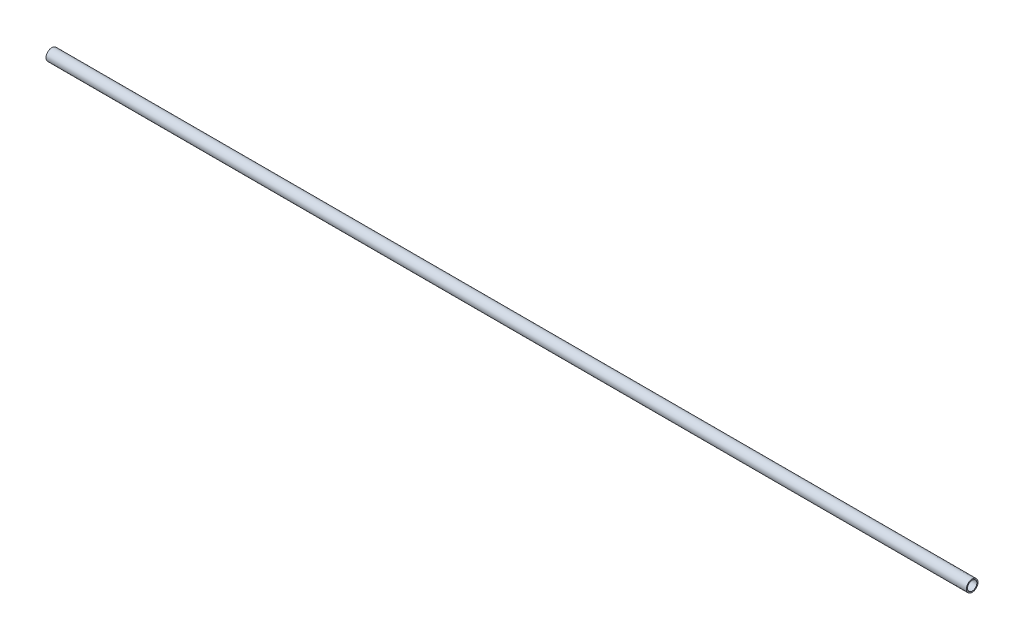
ISO-10303-21;
HEADER;
FILE_DESCRIPTION(('STEP AP214'),'2;1');
FILE_NAME('part.step','',(''),(''),'','','');
FILE_SCHEMA(('AUTOMOTIVE_DESIGN { 1 0 10303 214 1 1 1 1 }'));
ENDSEC;
DATA;
#1=APPLICATION_CONTEXT('core data for automotive mechanical design processes');
#2=APPLICATION_PROTOCOL_DEFINITION('international standard','automotive_design',2000,#1);
#3=PRODUCT_CONTEXT('',#1,'mechanical');
#4=PRODUCT('Part','Part','',(#3));
#5=PRODUCT_RELATED_PRODUCT_CATEGORY('part','',(#4));
#6=PRODUCT_DEFINITION_FORMATION('','',#4);
#7=PRODUCT_DEFINITION_CONTEXT('part definition',#1,'design');
#8=PRODUCT_DEFINITION('design','',#6,#7);
#9=PRODUCT_DEFINITION_SHAPE('','',#8);
#10=(LENGTH_UNIT() NAMED_UNIT(*) SI_UNIT(.MILLI.,.METRE.));
#11=(NAMED_UNIT(*) PLANE_ANGLE_UNIT() SI_UNIT($,.RADIAN.));
#12=(NAMED_UNIT(*) SI_UNIT($,.STERADIAN.) SOLID_ANGLE_UNIT());
#13=UNCERTAINTY_MEASURE_WITH_UNIT(LENGTH_MEASURE(1.E-05),#10,'distance_accuracy_value','');
#14=(GEOMETRIC_REPRESENTATION_CONTEXT(3) GLOBAL_UNCERTAINTY_ASSIGNED_CONTEXT((#13)) GLOBAL_UNIT_ASSIGNED_CONTEXT((#10,
#11,#12)) REPRESENTATION_CONTEXT('',''));
#15=CARTESIAN_POINT('',(0.,0.,0.));
#16=DIRECTION('',(0.,0.,1.));
#17=DIRECTION('',(1.,0.,0.));
#18=AXIS2_PLACEMENT_3D('',#15,#16,#17);
#19=CARTESIAN_POINT('',(40.,0.,0.));
#20=DIRECTION('',(1.,0.,0.));
#21=DIRECTION('',(0.,0.,-1.));
#22=AXIS2_PLACEMENT_3D('',#19,#20,#21);
#23=PLANE('',#22);
#24=CARTESIAN_POINT('',(40.,0.,0.));
#25=DIRECTION('',(1.,0.,0.));
#26=DIRECTION('',(0.,0.,-1.));
#27=AXIS2_PLACEMENT_3D('',#24,#25,#26);
#28=CIRCLE('',#27,0.254);
#29=CARTESIAN_POINT('',(40.,0.,-0.254));
#30=VERTEX_POINT('',#29);
#31=EDGE_CURVE('E10',#30,#30,#28,.T.);
#32=ORIENTED_EDGE('',*,*,#31,.T.);
#33=EDGE_LOOP('',(#32));
#34=FACE_BOUND('',#33,.T.);
#35=CARTESIAN_POINT('',(40.,0.,0.));
#36=DIRECTION('',(1.,0.,0.));
#37=DIRECTION('',(0.,0.,-1.));
#38=AXIS2_PLACEMENT_3D('',#35,#36,#37);
#39=CIRCLE('',#38,0.2032);
#40=CARTESIAN_POINT('',(40.,0.,-0.2032));
#41=VERTEX_POINT('',#40);
#42=EDGE_CURVE('E51',#41,#41,#39,.T.);
#43=ORIENTED_EDGE('',*,*,#42,.F.);
#44=EDGE_LOOP('',(#43));
#45=FACE_BOUND('',#44,.T.);
#46=ADVANCED_FACE('F33',(#34,#45),#23,.T.);
#47=CARTESIAN_POINT('',(0.,0.,0.));
#48=DIRECTION('',(1.,0.,0.));
#49=DIRECTION('',(0.,0.,-1.));
#50=AXIS2_PLACEMENT_3D('',#47,#48,#49);
#51=PLANE('',#50);
#52=CARTESIAN_POINT('',(0.,0.,0.));
#53=DIRECTION('',(1.,0.,0.));
#54=DIRECTION('',(0.,0.,-1.));
#55=AXIS2_PLACEMENT_3D('',#52,#53,#54);
#56=CIRCLE('',#55,0.254);
#57=CARTESIAN_POINT('',(0.,0.,-0.254));
#58=VERTEX_POINT('',#57);
#59=EDGE_CURVE('E46',#58,#58,#56,.T.);
#60=ORIENTED_EDGE('',*,*,#59,.F.);
#61=EDGE_LOOP('',(#60));
#62=FACE_BOUND('',#61,.T.);
#63=CARTESIAN_POINT('',(0.,0.,0.));
#64=DIRECTION('',(1.,0.,0.));
#65=DIRECTION('',(0.,0.,-1.));
#66=AXIS2_PLACEMENT_3D('',#63,#64,#65);
#67=CIRCLE('',#66,0.2032);
#68=CARTESIAN_POINT('',(0.,0.,-0.2032));
#69=VERTEX_POINT('',#68);
#70=EDGE_CURVE('E53',#69,#69,#67,.T.);
#71=ORIENTED_EDGE('',*,*,#70,.T.);
#72=EDGE_LOOP('',(#71));
#73=FACE_BOUND('',#72,.T.);
#74=ADVANCED_FACE('F73',(#62,#73),#51,.F.);
#75=CARTESIAN_POINT('',(40.,0.,0.));
#76=DIRECTION('',(-1.,0.,0.));
#77=DIRECTION('',(0.,0.,1.));
#78=AXIS2_PLACEMENT_3D('',#75,#76,#77);
#79=CYLINDRICAL_SURFACE('',#78,0.254);
#80=CARTESIAN_POINT('',(39.4196593617693,-0.156575860208404,0.199999999999996));
#81=CARTESIAN_POINT('',(39.4273232414501,-0.156578127590141,0.199998959837885));
#82=CARTESIAN_POINT('',(39.4349983210639,-0.157150101667018,0.199554493411874));
#83=CARTESIAN_POINT('',(39.4501099070562,-0.159331610656761,0.197816019316266));
#84=CARTESIAN_POINT('',(39.4575455392837,-0.160944575003501,0.196519203409457));
#85=CARTESIAN_POINT('',(39.4744411131732,-0.165622152728621,0.192606546141106));
#86=CARTESIAN_POINT('',(39.483745618685,-0.168991942500219,0.189694501187114));
#87=CARTESIAN_POINT('',(39.5015681079646,-0.176520052730397,0.182710468439602));
#88=CARTESIAN_POINT('',(39.510083872383,-0.180680503337848,0.178635331880377));
#89=CARTESIAN_POINT('',(39.529063125135,-0.190789428167503,0.167888122835688));
#90=CARTESIAN_POINT('',(39.5392232207103,-0.196869930901784,0.160803416076543));
#91=CARTESIAN_POINT('',(39.5581169555454,-0.208887470896208,0.144851504507567));
#92=CARTESIAN_POINT('',(39.5668517401028,-0.214824620045493,0.135985743759721));
#93=CARTESIAN_POINT('',(39.5811771888413,-0.224907920324756,0.118383825779077));
#94=CARTESIAN_POINT('',(39.5870495373387,-0.229179104691044,0.109949419826993));
#95=CARTESIAN_POINT('',(39.5975388740471,-0.236948729083354,0.0920130609990207));
#96=CARTESIAN_POINT('',(39.6021577759885,-0.240448345569685,0.08251276720155));
#97=CARTESIAN_POINT('',(39.609295915055,-0.245913929660451,0.0641787310714038));
#98=CARTESIAN_POINT('',(39.61203131012,-0.248034660266344,0.0554758120648191));
#99=CARTESIAN_POINT('',(39.616305170358,-0.25136379311449,0.0376111632010834));
#100=CARTESIAN_POINT('',(39.6178442779185,-0.252572684989426,0.0284496824016389));
#101=CARTESIAN_POINT('',(39.6196325215224,-0.253978253586905,0.00989281703171284));
#102=CARTESIAN_POINT('',(39.6198775138112,-0.25417167877498,0.000496777771226711));
#103=CARTESIAN_POINT('',(39.6190492468918,-0.253519746569042,-0.0182003547114571));
#104=CARTESIAN_POINT('',(39.6179758869564,-0.252674309801971,-0.0275014406241039));
#105=CARTESIAN_POINT('',(39.6146681290115,-0.250086847019841,-0.0452681776783455));
#106=CARTESIAN_POINT('',(39.6124945421666,-0.248391822740428,-0.0537523421483156));
#107=CARTESIAN_POINT('',(39.6071347467399,-0.244254222745689,-0.0701987526710312));
#108=CARTESIAN_POINT('',(39.6039482901956,-0.241811463981504,-0.0781608703441505));
#109=CARTESIAN_POINT('',(39.5963280031841,-0.236052853783652,-0.0942060382400424));
#110=CARTESIAN_POINT('',(39.5918015473612,-0.232674276725328,-0.102222154866371));
#111=CARTESIAN_POINT('',(39.5818314269053,-0.225397789925583,-0.117400207173861));
#112=CARTESIAN_POINT('',(39.5763871849547,-0.221499553626524,-0.124561600332938));
#113=CARTESIAN_POINT('',(39.5635031141067,-0.212558587838691,-0.139370353316671));
#114=CARTESIAN_POINT('',(39.555882863361,-0.207444827160126,-0.146817643070398));
#115=CARTESIAN_POINT('',(39.5395914169174,-0.197128614009353,-0.160402686953822));
#116=CARTESIAN_POINT('',(39.5309191242637,-0.191926073908227,-0.166539055472437));
#117=CARTESIAN_POINT('',(39.5137285214561,-0.182537558073003,-0.176742012103085));
#118=CARTESIAN_POINT('',(39.5053325389688,-0.178306692978332,-0.180972981908948));
#119=CARTESIAN_POINT('',(39.4877495375082,-0.170558850653808,-0.188292278784968));
#120=CARTESIAN_POINT('',(39.4785643171527,-0.167040308489364,-0.191383123214038));
#121=CARTESIAN_POINT('',(39.4620693092009,-0.162083282165824,-0.195582785156542));
#122=CARTESIAN_POINT('',(39.4549330570381,-0.160339127212091,-0.197002428434777));
#123=CARTESIAN_POINT('',(39.4403904286241,-0.157781183572826,-0.199057500688183));
#124=CARTESIAN_POINT('',(39.4329846242336,-0.156965531650072,-0.199694500407348));
#125=CARTESIAN_POINT('',(39.4180731634206,-0.156406141570308,-0.20013320610242));
#126=CARTESIAN_POINT('',(39.4105672140719,-0.156667042561435,-0.199931296974719));
#127=CARTESIAN_POINT('',(39.3957287595549,-0.15822103460147,-0.198703245619559));
#128=CARTESIAN_POINT('',(39.3883965260532,-0.159515644958736,-0.197675890167253));
#129=CARTESIAN_POINT('',(39.3720264603483,-0.163415368924034,-0.194471898072725));
#130=CARTESIAN_POINT('',(39.3631030346635,-0.166289953180502,-0.192050047883656));
#131=CARTESIAN_POINT('',(39.3459400190218,-0.172879251097439,-0.1861407143496));
#132=CARTESIAN_POINT('',(39.3377026376033,-0.176596544752892,-0.182649946703576));
#133=CARTESIAN_POINT('',(39.3187095510656,-0.18604764903528,-0.17310024676556));
#134=CARTESIAN_POINT('',(39.3082912866882,-0.191986925646759,-0.166574176288042));
#135=CARTESIAN_POINT('',(39.2888252972694,-0.203899265349916,-0.151762318087066));
#136=CARTESIAN_POINT('',(39.27977735208,-0.209872322854251,-0.143476813539686));
#137=CARTESIAN_POINT('',(39.2644433878661,-0.220413511625667,-0.126561494654802));
#138=CARTESIAN_POINT('',(39.2579466384245,-0.225057805705784,-0.118171076214495));
#139=CARTESIAN_POINT('',(39.2462417529336,-0.233610200087683,-0.100203971967722));
#140=CARTESIAN_POINT('',(39.2410314344573,-0.23751954450328,-0.0906293371936354));
#141=CARTESIAN_POINT('',(39.2329330725399,-0.243674199250097,-0.0722205221789213));
#142=CARTESIAN_POINT('',(39.2297975810038,-0.246091355928125,-0.0635532681055296));
#143=CARTESIAN_POINT('',(39.2247243030009,-0.250026178272363,-0.0456776455077952));
#144=CARTESIAN_POINT('',(39.222785831764,-0.251544358188755,-0.036469589663727));
#145=CARTESIAN_POINT('',(39.2202204312395,-0.253557182399072,-0.0177192905902397));
#146=CARTESIAN_POINT('',(39.21959906162,-0.254047487797213,-0.00817580291768501));
#147=CARTESIAN_POINT('',(39.2197289097175,-0.253945230503872,0.0108957583807674));
#148=CARTESIAN_POINT('',(39.2204800324169,-0.253352742774152,0.0204238330280025));
#149=CARTESIAN_POINT('',(39.2232040980725,-0.251217097791009,0.0385139858572853));
#150=CARTESIAN_POINT('',(39.2250901843585,-0.24974155916754,0.0470976188431021));
#151=CARTESIAN_POINT('',(39.2299047273509,-0.246009176930633,0.0637861387269432));
#152=CARTESIAN_POINT('',(39.2328334367438,-0.243752143920567,0.0718909090137917));
#153=CARTESIAN_POINT('',(39.2398785550218,-0.238393541717935,0.0881090064797993));
#154=CARTESIAN_POINT('',(39.2440711271354,-0.235238927916474,0.0961713426202595));
#155=CARTESIAN_POINT('',(39.2533737855544,-0.228379128837239,0.111487747143032));
#156=CARTESIAN_POINT('',(39.2584843043656,-0.2246736841688,0.118741431893465));
#157=CARTESIAN_POINT('',(39.2705832251006,-0.216142792924745,0.133740619608277));
#158=CARTESIAN_POINT('',(39.2777433436427,-0.211240234408174,0.141303437194555));
#159=CARTESIAN_POINT('',(39.293081268497,-0.201255932304763,0.155194307450927));
#160=CARTESIAN_POINT('',(39.3012604211987,-0.196173958153954,0.161520697556002));
#161=CARTESIAN_POINT('',(39.3182461871069,-0.186424142711708,0.172669052870223));
#162=CARTESIAN_POINT('',(39.327015481516,-0.181747874747502,0.177540392316429));
#163=CARTESIAN_POINT('',(39.345466288401,-0.173074007637781,0.186005247511024));
#164=CARTESIAN_POINT('',(39.355146101226,-0.169075181541164,0.189601086596413));
#165=CARTESIAN_POINT('',(39.3723501080437,-0.163430393000711,0.194463545011836));
#166=CARTESIAN_POINT('',(39.3796524177544,-0.161438434579087,0.196105179804854));
#167=CARTESIAN_POINT('',(39.3945754610713,-0.158406547648849,0.198563270632884));
#168=CARTESIAN_POINT('',(39.402194874224,-0.157363017672933,0.199382849500251));
#169=CARTESIAN_POINT('',(39.4131210855868,-0.15667765212623,0.199920152744218));
#170=CARTESIAN_POINT('',(39.4163892040883,-0.156574892722469,0.200000443834484));
#171=CARTESIAN_POINT('',(39.4196593617693,-0.156575860208404,0.199999999999996));
#172=B_SPLINE_CURVE_WITH_KNOTS('',3,(#80,#81,#82,#83,#84,#85,#86,#87,#88,#89,#90,#91,#92,#93,
#94,#95,#96,#97,#98,#99,#100,#101,#102,#103,#104,#105,#106,#107,#108,#109,#110,#111,#112,#113,
#114,#115,#116,#117,#118,#119,#120,#121,#122,#123,#124,#125,#126,#127,#128,#129,#130,#131,#132,
#133,#134,#135,#136,#137,#138,#139,#140,#141,#142,#143,#144,#145,#146,#147,#148,#149,#150,#151,
#152,#153,#154,#155,#156,#157,#158,#159,#160,#161,#162,#163,#164,#165,#166,#167,#168,#169,#170,
#171),.UNSPECIFIED.,.T.,.F.,(4,2,2,2,2,2,2,2,2,2,2,2,2,2,2,2,2,2,2,2,2,2,2,2,2,2,2,2,2,2,2,2,2,
2,2,2,2,2,2,2,2,2,2,2,2,4),(0.,0.0229801860502137,0.0460364670619781,0.0768097055048268,
0.107667057775144,0.148863253724962,0.190026182020082,0.223288244919045,0.25649923471716,
0.284477516345091,0.31244076367777,0.340493495236776,0.368548370265846,0.395198823674424,
0.421855806461919,0.451167697318883,0.480498095584494,0.515826068059614,0.551191198568207,
0.582030438299981,0.612801172552488,0.635162064059315,0.657478004178451,0.679890209728139,
0.702335416689861,0.731222080644151,0.760198406323362,0.800953441176442,0.841701921583522,
0.876319069120658,0.910877078869043,0.939344183970967,0.96779498899446,0.996365651589588,
1.02493433631286,1.05155388434719,1.07817988819951,1.10693193929675,1.13569757310911,
1.1701064571117,1.20456129548758,1.23766132705012,1.270700753157,1.29385203636044,
1.31691503536175,1.32672062144255),.UNSPECIFIED.);
#173=CARTESIAN_POINT('',(39.4196593617693,-0.156575860208404,0.199999999999996));
#174=VERTEX_POINT('',#173);
#175=EDGE_CURVE('E56',#174,#174,#172,.T.);
#176=ORIENTED_EDGE('',*,*,#175,.T.);
#177=EDGE_LOOP('',(#176));
#178=FACE_BOUND('',#177,.T.);
#179=ORIENTED_EDGE('',*,*,#31,.F.);
#180=EDGE_LOOP('',(#179));
#181=FACE_BOUND('',#180,.T.);
#182=ORIENTED_EDGE('',*,*,#59,.T.);
#183=EDGE_LOOP('',(#182));
#184=FACE_BOUND('',#183,.T.);
#185=ADVANCED_FACE('F35',(#178,#181,#184),#79,.T.);
#186=CARTESIAN_POINT('',(40.,0.,0.));
#187=DIRECTION('',(-1.,0.,0.));
#188=DIRECTION('',(0.,0.,1.));
#189=AXIS2_PLACEMENT_3D('',#186,#187,#188);
#190=CYLINDRICAL_SURFACE('',#189,0.2032);
#191=CARTESIAN_POINT('',(39.4196593617693,-0.0359199109130549,0.199999999999996));
#192=CARTESIAN_POINT('',(39.4223450395615,-0.0359209682305299,0.199999876802438));
#193=CARTESIAN_POINT('',(39.4250325716959,-0.0362302920392039,0.199944898363608));
#194=CARTESIAN_POINT('',(39.4302971537246,-0.0373720910723908,0.199734534340309));
#195=CARTESIAN_POINT('',(39.4328733494263,-0.0382080338333731,0.199578483045861));
#196=CARTESIAN_POINT('',(39.4407323563739,-0.0413476194680317,0.198959939669976));
#197=CARTESIAN_POINT('',(39.445752793223,-0.0442380641766276,0.198350907673561));
#198=CARTESIAN_POINT('',(39.4554039995754,-0.0505507585804063,0.196840248496954));
#199=CARTESIAN_POINT('',(39.4600311092492,-0.0539773044629976,0.195936187217804));
#200=CARTESIAN_POINT('',(39.4786844144566,-0.068488358575185,0.191646462931429));
#201=CARTESIAN_POINT('',(39.4918138085672,-0.0803894722204894,0.187066561267769));
#202=CARTESIAN_POINT('',(39.517078310249,-0.103773576055693,0.175210811880812));
#203=CARTESIAN_POINT('',(39.5292163335447,-0.115257732809936,0.167943245150935));
#204=CARTESIAN_POINT('',(39.5490228159344,-0.134230437749928,0.152887813717858));
#205=CARTESIAN_POINT('',(39.5569992310813,-0.141945887874345,0.145799229298648));
#206=CARTESIAN_POINT('',(39.5720451231787,-0.156553525052951,0.129988841878766));
#207=CARTESIAN_POINT('',(39.5791157924799,-0.163446793609733,0.121269224031169));
#208=CARTESIAN_POINT('',(39.5904475761775,-0.174521306396466,0.104442969441182));
#209=CARTESIAN_POINT('',(39.5949766105207,-0.178957301326143,0.0966858970503532));
#210=CARTESIAN_POINT('',(39.6030809844731,-0.186904062823742,0.0802503143430608));
#211=CARTESIAN_POINT('',(39.6066575240292,-0.190415993454255,0.0715729828280691));
#212=CARTESIAN_POINT('',(39.6121583060332,-0.195820990744767,0.0548554014703442));
#213=CARTESIAN_POINT('',(39.6142529423054,-0.197880816037918,0.0469256890402841));
#214=CARTESIAN_POINT('',(39.6174644038293,-0.201039776337299,0.0306843692817245));
#215=CARTESIAN_POINT('',(39.6185818007285,-0.202139472981335,0.0223729882138329));
#216=CARTESIAN_POINT('',(39.6197592042729,-0.20329824245699,0.00557731340179369));
#217=CARTESIAN_POINT('',(39.6198161003772,-0.203354254069511,-0.00290741595034345));
#218=CARTESIAN_POINT('',(39.6188600252585,-0.202413283578777,-0.0197567716822355));
#219=CARTESIAN_POINT('',(39.6178469149318,-0.201416164565645,-0.0281213823029184));
#220=CARTESIAN_POINT('',(39.6148926330312,-0.198509959663775,-0.0441294079361143));
#221=CARTESIAN_POINT('',(39.6129935412682,-0.196642226798648,-0.051788368008223));
#222=CARTESIAN_POINT('',(39.6083983979198,-0.192126216001779,-0.0666179577160249));
#223=CARTESIAN_POINT('',(39.6057020168103,-0.189477615334286,-0.0737883839272157));
#224=CARTESIAN_POINT('',(39.598439576718,-0.18235115515984,-0.0902635236567009));
#225=CARTESIAN_POINT('',(39.5935555529188,-0.177563839900898,-0.099294488361263));
#226=CARTESIAN_POINT('',(39.5827973505764,-0.167041728862688,-0.116130587922009));
#227=CARTESIAN_POINT('',(39.5769212510028,-0.161305095283538,-0.123933286641159));
#228=CARTESIAN_POINT('',(39.5621042183562,-0.146891090233397,-0.140997721672682));
#229=CARTESIAN_POINT('',(39.552836848791,-0.137914154079874,-0.149720712681309));
#230=CARTESIAN_POINT('',(39.5333436772241,-0.119188363802053,-0.165016088101743));
#231=CARTESIAN_POINT('',(39.5231159159839,-0.109437938299845,-0.171583947738208));
#232=CARTESIAN_POINT('',(39.5035449561735,-0.0912036953830133,-0.181837395383443));
#233=CARTESIAN_POINT('',(39.4943113593193,-0.0827585661770147,-0.185812306093995));
#234=CARTESIAN_POINT('',(39.4752614108141,-0.0659933141946444,-0.192385875913187));
#235=CARTESIAN_POINT('',(39.4654472667882,-0.057672851831072,-0.194989417334263));
#236=CARTESIAN_POINT('',(39.4519950296613,-0.0482951429907103,-0.197388966091068));
#237=CARTESIAN_POINT('',(39.4490905948284,-0.0463770492849708,-0.197845553798704));
#238=CARTESIAN_POINT('',(39.4430961770811,-0.0428193135753583,-0.198645264912919));
#239=CARTESIAN_POINT('',(39.4400064104488,-0.0411793552278641,-0.198988517650278));
#240=CARTESIAN_POINT('',(39.434665569918,-0.0388818243442155,-0.199447619796648));
#241=CARTESIAN_POINT('',(39.4324821360144,-0.0380793750458713,-0.199601123149156));
#242=CARTESIAN_POINT('',(39.4280171832702,-0.0368177372140882,-0.19983771139575));
#243=CARTESIAN_POINT('',(39.4257360408778,-0.0363573380488388,-0.199921044786298));
#244=CARTESIAN_POINT('',(39.4210957146048,-0.0358742756909067,-0.20000839203536));
#245=CARTESIAN_POINT('',(39.4187359308086,-0.0358567806473564,-0.200011469416933));
#246=CARTESIAN_POINT('',(39.4140584610763,-0.0362786945220467,-0.199935318525233));
#247=CARTESIAN_POINT('',(39.4117408545499,-0.0367188895514074,-0.199855948643887));
#248=CARTESIAN_POINT('',(39.4063575565404,-0.0381845429522139,-0.199581729739767));
#249=CARTESIAN_POINT('',(39.403338928662,-0.0393680030812923,-0.199354642978288));
#250=CARTESIAN_POINT('',(39.3974940883011,-0.0421311467313348,-0.198789614875699));
#251=CARTESIAN_POINT('',(39.3946690548499,-0.0437130235650378,-0.198451056596627));
#252=CARTESIAN_POINT('',(39.3816965678239,-0.0515985650672188,-0.196638617503945));
#253=CARTESIAN_POINT('',(39.3724034677051,-0.0591045340836741,-0.194570111823358));
#254=CARTESIAN_POINT('',(39.3544095150025,-0.074381703371813,-0.189281981216477));
#255=CARTESIAN_POINT('',(39.345711817191,-0.0821540313512027,-0.18605671646439));
#256=CARTESIAN_POINT('',(39.3249230201453,-0.101177787357188,-0.176661553579133));
#257=CARTESIAN_POINT('',(39.3130894648981,-0.11240242375354,-0.1698195559006));
#258=CARTESIAN_POINT('',(39.290592208871,-0.133942376295508,-0.153406669149494));
#259=CARTESIAN_POINT('',(39.2799243264368,-0.144260914860033,-0.143846009670579));
#260=CARTESIAN_POINT('',(39.2640568733363,-0.159687629519487,-0.125982036093379));
#261=CARTESIAN_POINT('',(39.2583193732362,-0.165286158395173,-0.118580548932561));
#262=CARTESIAN_POINT('',(39.2477337250542,-0.175634560586067,-0.102629812546351));
#263=CARTESIAN_POINT('',(39.2428845179199,-0.180385444313656,-0.0940819514158115));
#264=CARTESIAN_POINT('',(39.2350869336657,-0.188033875032324,-0.0774730936868788));
#265=CARTESIAN_POINT('',(39.2319550652985,-0.191109652789989,-0.0695813147010702));
#266=CARTESIAN_POINT('',(39.2266662700892,-0.196306739931506,-0.0531765724914181));
#267=CARTESIAN_POINT('',(39.2245087252618,-0.19842865431942,-0.0446640070058993));
#268=CARTESIAN_POINT('',(39.2213131167558,-0.201572290355519,-0.0271705689621363));
#269=CARTESIAN_POINT('',(39.2202822753179,-0.202586914137894,-0.0181870575721794));
#270=CARTESIAN_POINT('',(39.2194551029789,-0.20340103083682,-0.000109079085930496));
#271=CARTESIAN_POINT('',(39.2196583106682,-0.203200977919737,0.00898534527094863));
#272=CARTESIAN_POINT('',(39.2211926754478,-0.201690979326478,0.0260050017739182));
#273=CARTESIAN_POINT('',(39.222402833643,-0.200500096638115,0.0339525274964295));
#274=CARTESIAN_POINT('',(39.2257121645579,-0.197245192109822,0.0494719610811296));
#275=CARTESIAN_POINT('',(39.2278114976344,-0.195181012776615,0.0570438009155212));
#276=CARTESIAN_POINT('',(39.2329111573368,-0.190170700113782,0.0720499018708407));
#277=CARTESIAN_POINT('',(39.2359527740443,-0.187184174295769,0.079456378497267));
#278=CARTESIAN_POINT('',(39.2427409699939,-0.180526766259493,0.0936032190361034));
#279=CARTESIAN_POINT('',(39.2464878595796,-0.176855582775729,0.100343287707837));
#280=CARTESIAN_POINT('',(39.2567855325796,-0.166782629112715,0.11666127576048));
#281=CARTESIAN_POINT('',(39.2637408009844,-0.159993759345331,0.125746541027557));
#282=CARTESIAN_POINT('',(39.2786365954087,-0.145514195327047,0.142256914719384));
#283=CARTESIAN_POINT('',(39.2865802212372,-0.137820668143438,0.149676584345826));
#284=CARTESIAN_POINT('',(39.3061967527781,-0.118973857497921,0.165334213854826));
#285=CARTESIAN_POINT('',(39.3181774896442,-0.107577588946257,0.172893384541268));
#286=CARTESIAN_POINT('',(39.3430752193131,-0.0844340895006477,0.185286017429951));
#287=CARTESIAN_POINT('',(39.3559904565147,-0.0726875398863773,0.190124448228639));
#288=CARTESIAN_POINT('',(39.3768811118311,-0.05568871717359,0.195511408676135));
#289=CARTESIAN_POINT('',(39.3842390475637,-0.0500338938573947,0.197003688670013));
#290=CARTESIAN_POINT('',(39.3947205247319,-0.0436872850475221,0.198454988128959));
#291=CARTESIAN_POINT('',(39.3973142049603,-0.0422387064285263,0.198765996642409));
#292=CARTESIAN_POINT('',(39.40266890669,-0.0396652082737693,0.199295191748862));
#293=CARTESIAN_POINT('',(39.4054295311272,-0.0385395547114188,0.199513589401044));
#294=CARTESIAN_POINT('',(39.4101216663936,-0.0371235024117518,0.199780953384737));
#295=CARTESIAN_POINT('',(39.412003202717,-0.0366785758368417,0.199862495952521));
#296=CARTESIAN_POINT('',(39.4158093961066,-0.0360768430264589,0.199971981198769));
#297=CARTESIAN_POINT('',(39.4177339023744,-0.035919152883975,0.200000088324773));
#298=CARTESIAN_POINT('',(39.4196593617693,-0.0359199109130549,0.199999999999996));
#299=B_SPLINE_CURVE_WITH_KNOTS('',3,(#191,#192,#193,#194,#195,#196,#197,#198,#199,#200,#201,
#202,#203,#204,#205,#206,#207,#208,#209,#210,#211,#212,#213,#214,#215,#216,#217,#218,#219,#220,
#221,#222,#223,#224,#225,#226,#227,#228,#229,#230,#231,#232,#233,#234,#235,#236,#237,#238,#239,
#240,#241,#242,#243,#244,#245,#246,#247,#248,#249,#250,#251,#252,#253,#254,#255,#256,#257,#258,
#259,#260,#261,#262,#263,#264,#265,#266,#267,#268,#269,#270,#271,#272,#273,#274,#275,#276,#277,
#278,#279,#280,#281,#282,#283,#284,#285,#286,#287,#288,#289,#290,#291,#292,#293,#294,#295,#296,
#297,#298),.UNSPECIFIED.,.T.,.F.,(4,2,2,2,2,2,2,2,2,2,2,2,2,2,2,2,2,2,2,2,2,2,2,2,2,2,2,2,2,2,2,
2,2,2,2,2,2,2,2,2,2,2,2,2,2,2,2,2,2,2,2,2,2,4),(0.,0.00804656834344771,0.0161466813816539,
0.0334806475263459,0.050961402290375,0.105547112252802,0.159966020109998,0.199340544983469,
0.238662691410325,0.268609069241271,0.298517540419587,0.323778385643212,0.349024444338422,
0.374344540304259,0.399667928357397,0.423894931167721,0.448131961164916,0.48192905420197,
0.515792357845161,0.5622663473027,0.608837295374158,0.648169678850292,0.687361069246918,
0.69788411510497,0.708395110881693,0.715369166134137,0.722318418679016,0.729348723585946,
0.736391123456558,0.746086339921389,0.755836142659337,0.79194771778492,0.828237804680308,
0.881047107824931,0.933660275053815,0.966288680673008,0.998877928783603,1.02586078516278,
1.05282650297506,1.07996407703052,1.10709150500002,1.13136304881426,1.15563897170812,
1.18118133467072,1.20673496350712,1.24642424184683,1.28624129411276,1.3404957676201,
1.39465083750539,1.42271791188043,1.43166568368855,1.44059295257382,1.44637966561552,
1.45214854103984),.UNSPECIFIED.);
#300=CARTESIAN_POINT('',(39.4196593617693,-0.0359199109130549,0.199999999999996));
#301=VERTEX_POINT('',#300);
#302=EDGE_CURVE('E38',#301,#301,#299,.T.);
#303=ORIENTED_EDGE('',*,*,#302,.F.);
#304=EDGE_LOOP('',(#303));
#305=FACE_BOUND('',#304,.T.);
#306=ORIENTED_EDGE('',*,*,#42,.T.);
#307=EDGE_LOOP('',(#306));
#308=FACE_BOUND('',#307,.T.);
#309=ORIENTED_EDGE('',*,*,#70,.F.);
#310=EDGE_LOOP('',(#309));
#311=FACE_BOUND('',#310,.T.);
#312=ADVANCED_FACE('F65',(#305,#308,#311),#190,.F.);
#313=CARTESIAN_POINT('',(39.4196593617693,-10.,0.));
#314=DIRECTION('',(0.,1.,0.));
#315=DIRECTION('',(0.,0.,1.));
#316=AXIS2_PLACEMENT_3D('',#313,#314,#315);
#317=CYLINDRICAL_SURFACE('',#316,0.199999999999996);
#318=ORIENTED_EDGE('',*,*,#302,.T.);
#319=EDGE_LOOP('',(#318));
#320=FACE_BOUND('',#319,.T.);
#321=ORIENTED_EDGE('',*,*,#175,.F.);
#322=EDGE_LOOP('',(#321));
#323=FACE_BOUND('',#322,.T.);
#324=ADVANCED_FACE('F62',(#320,#323),#317,.F.);
#325=CLOSED_SHELL('',(#46,#74,#185,#312,#324));
#326=MANIFOLD_SOLID_BREP('B2',#325);
#327=ADVANCED_BREP_SHAPE_REPRESENTATION('',(#18,#326),#14);
#328=SHAPE_DEFINITION_REPRESENTATION(#9,#327);
ENDSEC;
END-ISO-10303-21;
